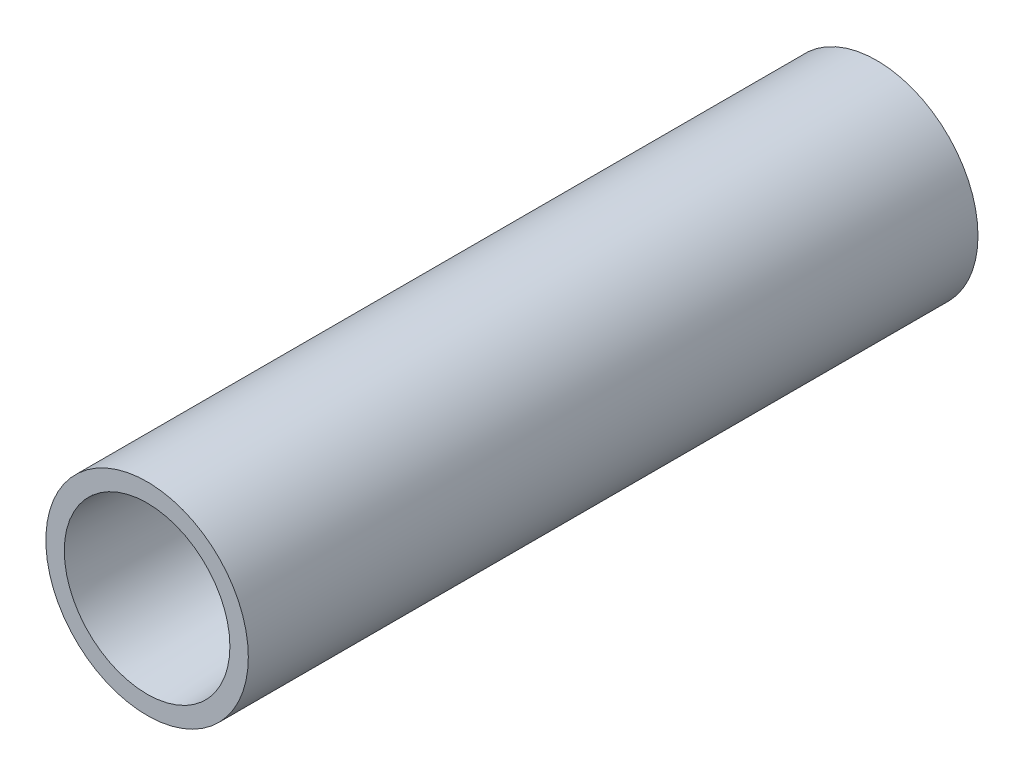
ISO-10303-21;
HEADER;
FILE_DESCRIPTION(('STEP AP214'),'2;1');
FILE_NAME('part.step','',(''),(''),'','','');
FILE_SCHEMA(('AUTOMOTIVE_DESIGN { 1 0 10303 214 1 1 1 1 }'));
ENDSEC;
DATA;
#1=APPLICATION_CONTEXT('core data for automotive mechanical design processes');
#2=APPLICATION_PROTOCOL_DEFINITION('international standard','automotive_design',2000,#1);
#3=PRODUCT_CONTEXT('',#1,'mechanical');
#4=PRODUCT('Part','Part','',(#3));
#5=PRODUCT_RELATED_PRODUCT_CATEGORY('part','',(#4));
#6=PRODUCT_DEFINITION_FORMATION('','',#4);
#7=PRODUCT_DEFINITION_CONTEXT('part definition',#1,'design');
#8=PRODUCT_DEFINITION('design','',#6,#7);
#9=PRODUCT_DEFINITION_SHAPE('','',#8);
#10=(LENGTH_UNIT() NAMED_UNIT(*) SI_UNIT(.MILLI.,.METRE.));
#11=(NAMED_UNIT(*) PLANE_ANGLE_UNIT() SI_UNIT($,.RADIAN.));
#12=(NAMED_UNIT(*) SI_UNIT($,.STERADIAN.) SOLID_ANGLE_UNIT());
#13=UNCERTAINTY_MEASURE_WITH_UNIT(LENGTH_MEASURE(1.E-05),#10,'distance_accuracy_value','');
#14=(GEOMETRIC_REPRESENTATION_CONTEXT(3) GLOBAL_UNCERTAINTY_ASSIGNED_CONTEXT((#13)) GLOBAL_UNIT_ASSIGNED_CONTEXT((#10,
#11,#12)) REPRESENTATION_CONTEXT('',''));
#15=CARTESIAN_POINT('',(0.,0.,0.));
#16=DIRECTION('',(0.,0.,1.));
#17=DIRECTION('',(1.,0.,0.));
#18=AXIS2_PLACEMENT_3D('',#15,#16,#17);
#19=CARTESIAN_POINT('',(0.,0.,20.));
#20=DIRECTION('',(0.,0.,-1.));
#21=DIRECTION('',(-1.,0.,0.));
#22=AXIS2_PLACEMENT_3D('',#19,#20,#21);
#23=CYLINDRICAL_SURFACE('',#22,1.);
#24=CARTESIAN_POINT('',(0.,0.,5.68));
#25=DIRECTION('',(0.,0.,1.));
#26=DIRECTION('',(1.,0.,0.));
#27=AXIS2_PLACEMENT_3D('',#24,#25,#26);
#28=CIRCLE('',#27,1.);
#29=CARTESIAN_POINT('',(1.,0.,5.68));
#30=VERTEX_POINT('',#29);
#31=EDGE_CURVE('E51',#30,#30,#28,.F.);
#32=ORIENTED_EDGE('',*,*,#31,.T.);
#33=EDGE_LOOP('',(#32));
#34=FACE_BOUND('',#33,.T.);
#35=CARTESIAN_POINT('',(0.,0.,14.32));
#36=DIRECTION('',(0.,0.,1.));
#37=DIRECTION('',(1.,0.,0.));
#38=AXIS2_PLACEMENT_3D('',#35,#36,#37);
#39=CIRCLE('',#38,1.);
#40=CARTESIAN_POINT('',(1.,0.,14.32));
#41=VERTEX_POINT('',#40);
#42=EDGE_CURVE('E38',#41,#41,#39,.T.);
#43=ORIENTED_EDGE('',*,*,#42,.T.);
#44=EDGE_LOOP('',(#43));
#45=FACE_BOUND('',#44,.T.);
#46=ADVANCED_FACE('F34',(#34,#45),#23,.F.);
#47=CARTESIAN_POINT('',(0.,0.,20.));
#48=DIRECTION('',(0.,0.,-1.));
#49=DIRECTION('',(-1.,0.,0.));
#50=AXIS2_PLACEMENT_3D('',#47,#48,#49);
#51=CYLINDRICAL_SURFACE('',#50,2.775);
#52=CARTESIAN_POINT('',(0.,0.,20.));
#53=DIRECTION('',(0.,0.,1.));
#54=DIRECTION('',(1.,0.,0.));
#55=AXIS2_PLACEMENT_3D('',#52,#53,#54);
#56=CIRCLE('',#55,2.775);
#57=CARTESIAN_POINT('',(2.775,0.,20.));
#58=VERTEX_POINT('',#57);
#59=EDGE_CURVE('E10',#58,#58,#56,.T.);
#60=ORIENTED_EDGE('',*,*,#59,.F.);
#61=EDGE_LOOP('',(#60));
#62=FACE_BOUND('',#61,.T.);
#63=CARTESIAN_POINT('',(0.,0.,0.));
#64=DIRECTION('',(0.,0.,1.));
#65=DIRECTION('',(1.,0.,0.));
#66=AXIS2_PLACEMENT_3D('',#63,#64,#65);
#67=CIRCLE('',#66,2.775);
#68=CARTESIAN_POINT('',(2.775,0.,0.));
#69=VERTEX_POINT('',#68);
#70=EDGE_CURVE('E42',#69,#69,#67,.T.);
#71=ORIENTED_EDGE('',*,*,#70,.T.);
#72=EDGE_LOOP('',(#71));
#73=FACE_BOUND('',#72,.T.);
#74=ADVANCED_FACE('F36',(#62,#73),#51,.T.);
#75=CARTESIAN_POINT('',(0.,0.,20.));
#76=DIRECTION('',(0.,0.,1.));
#77=DIRECTION('',(1.,0.,0.));
#78=AXIS2_PLACEMENT_3D('',#75,#76,#77);
#79=PLANE('',#78);
#80=CARTESIAN_POINT('',(0.,0.,20.));
#81=DIRECTION('',(0.,0.,1.));
#82=DIRECTION('',(1.,0.,0.));
#83=AXIS2_PLACEMENT_3D('',#80,#81,#82);
#84=CIRCLE('',#83,2.27);
#85=CARTESIAN_POINT('',(2.27,0.,20.));
#86=VERTEX_POINT('',#85);
#87=EDGE_CURVE('E62',#86,#86,#84,.T.);
#88=ORIENTED_EDGE('',*,*,#87,.F.);
#89=EDGE_LOOP('',(#88));
#90=FACE_BOUND('',#89,.T.);
#91=ORIENTED_EDGE('',*,*,#59,.T.);
#92=EDGE_LOOP('',(#91));
#93=FACE_BOUND('',#92,.T.);
#94=ADVANCED_FACE('F72',(#90,#93),#79,.T.);
#95=CARTESIAN_POINT('',(0.,0.,0.));
#96=DIRECTION('',(0.,0.,1.));
#97=DIRECTION('',(1.,0.,0.));
#98=AXIS2_PLACEMENT_3D('',#95,#96,#97);
#99=PLANE('',#98);
#100=CARTESIAN_POINT('',(0.,0.,0.));
#101=DIRECTION('',(0.,0.,1.));
#102=DIRECTION('',(1.,0.,0.));
#103=AXIS2_PLACEMENT_3D('',#100,#101,#102);
#104=CIRCLE('',#103,2.27);
#105=CARTESIAN_POINT('',(2.27,0.,0.));
#106=VERTEX_POINT('',#105);
#107=EDGE_CURVE('E53',#106,#106,#104,.T.);
#108=ORIENTED_EDGE('',*,*,#107,.T.);
#109=EDGE_LOOP('',(#108));
#110=FACE_BOUND('',#109,.T.);
#111=ORIENTED_EDGE('',*,*,#70,.F.);
#112=EDGE_LOOP('',(#111));
#113=FACE_BOUND('',#112,.T.);
#114=ADVANCED_FACE('F74',(#110,#113),#99,.F.);
#115=CARTESIAN_POINT('',(0.,0.,0.));
#116=DIRECTION('',(0.,0.,-1.));
#117=DIRECTION('',(1.,0.,0.));
#118=AXIS2_PLACEMENT_3D('',#115,#116,#117);
#119=CONICAL_SURFACE('',#118,2.27,0.0536514212063058);
#120=CARTESIAN_POINT('',(0.,0.,5.68));
#121=DIRECTION('',(0.,0.,1.));
#122=DIRECTION('',(1.,0.,0.));
#123=AXIS2_PLACEMENT_3D('',#120,#121,#122);
#124=CIRCLE('',#123,1.9649671949344);
#125=CARTESIAN_POINT('',(1.9649671949344,0.,5.68));
#126=VERTEX_POINT('',#125);
#127=EDGE_CURVE('E47',#126,#126,#124,.T.);
#128=ORIENTED_EDGE('',*,*,#127,.T.);
#129=EDGE_LOOP('',(#128));
#130=FACE_BOUND('',#129,.T.);
#131=ORIENTED_EDGE('',*,*,#107,.F.);
#132=EDGE_LOOP('',(#131));
#133=FACE_BOUND('',#132,.T.);
#134=ADVANCED_FACE('F80',(#130,#133),#119,.F.);
#135=CARTESIAN_POINT('',(0.,0.,5.68));
#136=DIRECTION('',(0.,0.,1.));
#137=DIRECTION('',(1.,0.,0.));
#138=AXIS2_PLACEMENT_3D('',#135,#136,#137);
#139=PLANE('',#138);
#140=ORIENTED_EDGE('',*,*,#31,.F.);
#141=EDGE_LOOP('',(#140));
#142=FACE_BOUND('',#141,.T.);
#143=ORIENTED_EDGE('',*,*,#127,.F.);
#144=EDGE_LOOP('',(#143));
#145=FACE_BOUND('',#144,.T.);
#146=ADVANCED_FACE('F91',(#142,#145),#139,.F.);
#147=CARTESIAN_POINT('',(0.,0.,20.));
#148=DIRECTION('',(0.,0.,1.));
#149=DIRECTION('',(1.,0.,0.));
#150=AXIS2_PLACEMENT_3D('',#147,#148,#149);
#151=CONICAL_SURFACE('',#150,2.27,0.0536514212063058);
#152=CARTESIAN_POINT('',(0.,0.,14.32));
#153=DIRECTION('',(0.,0.,1.));
#154=DIRECTION('',(1.,0.,0.));
#155=AXIS2_PLACEMENT_3D('',#152,#153,#154);
#156=CIRCLE('',#155,1.9649671949344);
#157=CARTESIAN_POINT('',(1.9649671949344,0.,14.32));
#158=VERTEX_POINT('',#157);
#159=EDGE_CURVE('E58',#158,#158,#156,.T.);
#160=ORIENTED_EDGE('',*,*,#159,.F.);
#161=EDGE_LOOP('',(#160));
#162=FACE_BOUND('',#161,.T.);
#163=ORIENTED_EDGE('',*,*,#87,.T.);
#164=EDGE_LOOP('',(#163));
#165=FACE_BOUND('',#164,.T.);
#166=ADVANCED_FACE('F70',(#162,#165),#151,.F.);
#167=CARTESIAN_POINT('',(0.,0.,14.32));
#168=DIRECTION('',(0.,0.,1.));
#169=DIRECTION('',(1.,0.,0.));
#170=AXIS2_PLACEMENT_3D('',#167,#168,#169);
#171=PLANE('',#170);
#172=ORIENTED_EDGE('',*,*,#42,.F.);
#173=EDGE_LOOP('',(#172));
#174=FACE_BOUND('',#173,.T.);
#175=ORIENTED_EDGE('',*,*,#159,.T.);
#176=EDGE_LOOP('',(#175));
#177=FACE_BOUND('',#176,.T.);
#178=ADVANCED_FACE('F118',(#174,#177),#171,.T.);
#179=CLOSED_SHELL('',(#46,#74,#94,#114,#134,#146,#166,#178));
#180=MANIFOLD_SOLID_BREP('B2',#179);
#181=ADVANCED_BREP_SHAPE_REPRESENTATION('',(#18,#180),#14);
#182=SHAPE_DEFINITION_REPRESENTATION(#9,#181);
ENDSEC;
END-ISO-10303-21;
